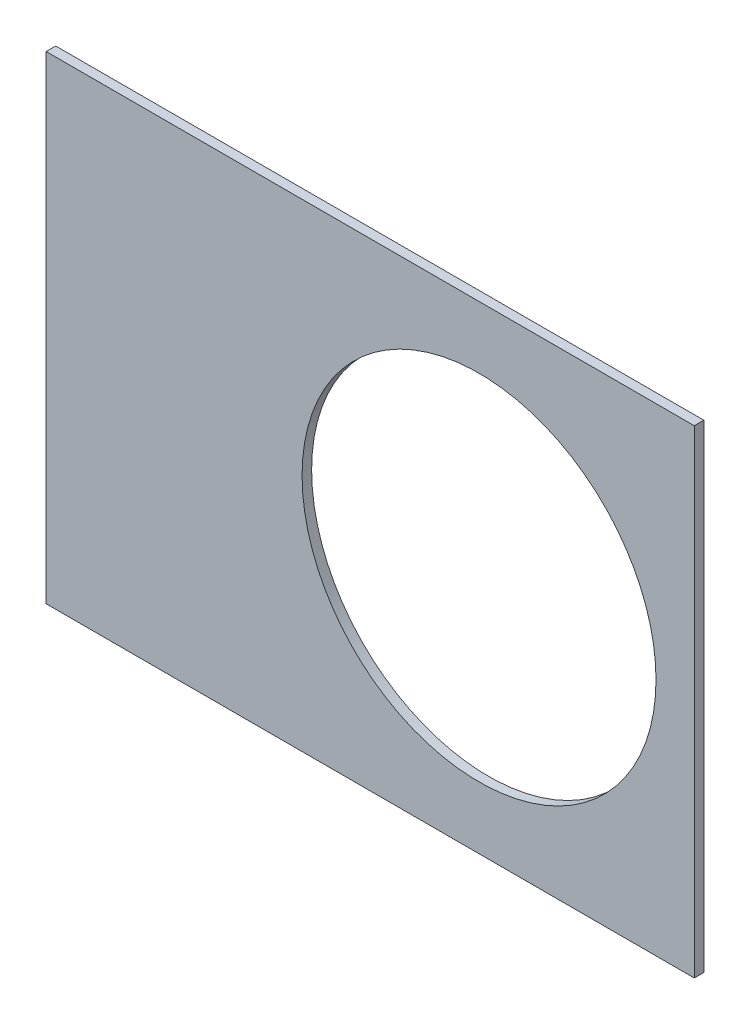
ISO-10303-21;
HEADER;
FILE_DESCRIPTION(('STEP AP214'),'2;1');
FILE_NAME('part.step','',(''),(''),'','','');
FILE_SCHEMA(('AUTOMOTIVE_DESIGN { 1 0 10303 214 1 1 1 1 }'));
ENDSEC;
DATA;
#1=APPLICATION_CONTEXT('core data for automotive mechanical design processes');
#2=APPLICATION_PROTOCOL_DEFINITION('international standard','automotive_design',2000,#1);
#3=PRODUCT_CONTEXT('',#1,'mechanical');
#4=PRODUCT('Part','Part','',(#3));
#5=PRODUCT_RELATED_PRODUCT_CATEGORY('part','',(#4));
#6=PRODUCT_DEFINITION_FORMATION('','',#4);
#7=PRODUCT_DEFINITION_CONTEXT('part definition',#1,'design');
#8=PRODUCT_DEFINITION('design','',#6,#7);
#9=PRODUCT_DEFINITION_SHAPE('','',#8);
#10=(LENGTH_UNIT() NAMED_UNIT(*) SI_UNIT(.MILLI.,.METRE.));
#11=(NAMED_UNIT(*) PLANE_ANGLE_UNIT() SI_UNIT($,.RADIAN.));
#12=(NAMED_UNIT(*) SI_UNIT($,.STERADIAN.) SOLID_ANGLE_UNIT());
#13=UNCERTAINTY_MEASURE_WITH_UNIT(LENGTH_MEASURE(1.E-05),#10,'distance_accuracy_value','');
#14=(GEOMETRIC_REPRESENTATION_CONTEXT(3) GLOBAL_UNCERTAINTY_ASSIGNED_CONTEXT((#13)) GLOBAL_UNIT_ASSIGNED_CONTEXT((#10,
#11,#12)) REPRESENTATION_CONTEXT('',''));
#15=CARTESIAN_POINT('',(0.,0.,0.));
#16=DIRECTION('',(0.,0.,1.));
#17=DIRECTION('',(1.,0.,0.));
#18=AXIS2_PLACEMENT_3D('',#15,#16,#17);
#19=CARTESIAN_POINT('',(0.,0.,0.254));
#20=DIRECTION('',(0.,0.,-1.));
#21=DIRECTION('',(-1.,0.,0.));
#22=AXIS2_PLACEMENT_3D('',#19,#20,#21);
#23=PLANE('',#22);
#24=CARTESIAN_POINT('',(61.722,0.,0.254));
#25=DIRECTION('',(0.,0.,1.));
#26=DIRECTION('',(1.,0.,0.));
#27=AXIS2_PLACEMENT_3D('',#24,#25,#26);
#28=CIRCLE('',#27,4.69899999999999);
#29=CARTESIAN_POINT('',(66.421,0.,0.254));
#30=VERTEX_POINT('',#29);
#31=EDGE_CURVE('E99',#30,#30,#28,.T.);
#32=ORIENTED_EDGE('',*,*,#31,.F.);
#33=EDGE_LOOP('',(#32));
#34=FACE_BOUND('',#33,.T.);
#35=DIRECTION('',(1.,0.,0.));
#36=VECTOR('',#35,1.);
#37=CARTESIAN_POINT('',(88.6729242779328,6.35,0.254));
#38=LINE('',#37,#36);
#39=CARTESIAN_POINT('',(50.2285,6.34999999999999,0.254));
#40=VERTEX_POINT('',#39);
#41=CARTESIAN_POINT('',(67.437,6.35,0.254));
#42=VERTEX_POINT('',#41);
#43=EDGE_CURVE('E88',#40,#42,#38,.T.);
#44=ORIENTED_EDGE('',*,*,#43,.F.);
#45=DIRECTION('',(0.,1.,0.));
#46=VECTOR('',#45,1.);
#47=CARTESIAN_POINT('',(50.2285,-6.35000000000001,0.254));
#48=LINE('',#47,#46);
#49=CARTESIAN_POINT('',(50.2285,-6.35000000000001,0.254));
#50=VERTEX_POINT('',#49);
#51=EDGE_CURVE('E72',#50,#40,#48,.T.);
#52=ORIENTED_EDGE('',*,*,#51,.F.);
#53=DIRECTION('',(1.,0.,0.));
#54=VECTOR('',#53,1.);
#55=CARTESIAN_POINT('',(101.401368333963,-6.35,0.254));
#56=LINE('',#55,#54);
#57=CARTESIAN_POINT('',(67.437,-6.35000000000001,0.254));
#58=VERTEX_POINT('',#57);
#59=EDGE_CURVE('E12',#50,#58,#56,.T.);
#60=ORIENTED_EDGE('',*,*,#59,.T.);
#61=DIRECTION('',(0.,-1.,0.));
#62=VECTOR('',#61,1.);
#63=CARTESIAN_POINT('',(67.437,-6.35000000000001,0.254));
#64=LINE('',#63,#62);
#65=EDGE_CURVE('E93',#42,#58,#64,.T.);
#66=ORIENTED_EDGE('',*,*,#65,.F.);
#67=EDGE_LOOP('',(#44,#52,#60,#66));
#68=FACE_BOUND('',#67,.T.);
#69=ADVANCED_FACE('F35',(#34,#68),#23,.F.);
#70=CARTESIAN_POINT('',(0.,0.,0.));
#71=DIRECTION('',(0.,0.,-1.));
#72=DIRECTION('',(-1.,0.,0.));
#73=AXIS2_PLACEMENT_3D('',#70,#71,#72);
#74=PLANE('',#73);
#75=CARTESIAN_POINT('',(61.722,0.,0.));
#76=DIRECTION('',(0.,0.,1.));
#77=DIRECTION('',(1.,0.,0.));
#78=AXIS2_PLACEMENT_3D('',#75,#76,#77);
#79=CIRCLE('',#78,4.69899999999999);
#80=CARTESIAN_POINT('',(66.421,0.,0.));
#81=VERTEX_POINT('',#80);
#82=EDGE_CURVE('E96',#81,#81,#79,.T.);
#83=ORIENTED_EDGE('',*,*,#82,.T.);
#84=EDGE_LOOP('',(#83));
#85=FACE_BOUND('',#84,.T.);
#86=DIRECTION('',(0.,1.,0.));
#87=VECTOR('',#86,1.);
#88=CARTESIAN_POINT('',(50.2285,-6.35000000000001,0.));
#89=LINE('',#88,#87);
#90=CARTESIAN_POINT('',(50.2285,-6.35000000000001,0.));
#91=VERTEX_POINT('',#90);
#92=CARTESIAN_POINT('',(50.2285,6.34999999999999,0.));
#93=VERTEX_POINT('',#92);
#94=EDGE_CURVE('E81',#91,#93,#89,.T.);
#95=ORIENTED_EDGE('',*,*,#94,.T.);
#96=DIRECTION('',(1.,0.,0.));
#97=VECTOR('',#96,1.);
#98=CARTESIAN_POINT('',(88.6729242779328,6.35,0.));
#99=LINE('',#98,#97);
#100=CARTESIAN_POINT('',(67.437,6.35,0.));
#101=VERTEX_POINT('',#100);
#102=EDGE_CURVE('E90',#93,#101,#99,.T.);
#103=ORIENTED_EDGE('',*,*,#102,.T.);
#104=DIRECTION('',(0.,-1.,0.));
#105=VECTOR('',#104,1.);
#106=CARTESIAN_POINT('',(67.437,-6.35000000000001,0.));
#107=LINE('',#106,#105);
#108=CARTESIAN_POINT('',(67.437,-6.35000000000001,0.));
#109=VERTEX_POINT('',#108);
#110=EDGE_CURVE('E106',#101,#109,#107,.T.);
#111=ORIENTED_EDGE('',*,*,#110,.T.);
#112=DIRECTION('',(1.,0.,0.));
#113=VECTOR('',#112,1.);
#114=CARTESIAN_POINT('',(101.401368333963,-6.35,0.));
#115=LINE('',#114,#113);
#116=EDGE_CURVE('E39',#91,#109,#115,.T.);
#117=ORIENTED_EDGE('',*,*,#116,.F.);
#118=EDGE_LOOP('',(#95,#103,#111,#117));
#119=FACE_BOUND('',#118,.T.);
#120=ADVANCED_FACE('F114',(#85,#119),#74,.T.);
#121=CARTESIAN_POINT('',(88.6729242779328,6.35,0.254));
#122=DIRECTION('',(0.,1.,0.));
#123=DIRECTION('',(-1.,0.,0.));
#124=AXIS2_PLACEMENT_3D('',#121,#122,#123);
#125=PLANE('',#124);
#126=ORIENTED_EDGE('',*,*,#102,.F.);
#127=DIRECTION('',(0.,0.,1.));
#128=VECTOR('',#127,1.);
#129=CARTESIAN_POINT('',(50.2285,6.34999999999999,0.254));
#130=LINE('',#129,#128);
#131=EDGE_CURVE('E75',#93,#40,#130,.T.);
#132=ORIENTED_EDGE('',*,*,#131,.T.);
#133=ORIENTED_EDGE('',*,*,#43,.T.);
#134=DIRECTION('',(0.,0.,-1.));
#135=VECTOR('',#134,1.);
#136=CARTESIAN_POINT('',(67.437,6.35,0.254));
#137=LINE('',#136,#135);
#138=EDGE_CURVE('E82',#42,#101,#137,.T.);
#139=ORIENTED_EDGE('',*,*,#138,.T.);
#140=EDGE_LOOP('',(#126,#132,#133,#139));
#141=FACE_BOUND('',#140,.T.);
#142=ADVANCED_FACE('F86',(#141),#125,.T.);
#143=CARTESIAN_POINT('',(101.401368333963,-6.35,0.254));
#144=DIRECTION('',(0.,1.,0.));
#145=DIRECTION('',(-1.,0.,0.));
#146=AXIS2_PLACEMENT_3D('',#143,#144,#145);
#147=PLANE('',#146);
#148=ORIENTED_EDGE('',*,*,#59,.F.);
#149=DIRECTION('',(0.,0.,1.));
#150=VECTOR('',#149,1.);
#151=CARTESIAN_POINT('',(50.2285,-6.35000000000001,0.));
#152=LINE('',#151,#150);
#153=EDGE_CURVE('E77',#91,#50,#152,.T.);
#154=ORIENTED_EDGE('',*,*,#153,.F.);
#155=ORIENTED_EDGE('',*,*,#116,.T.);
#156=DIRECTION('',(0.,0.,1.));
#157=VECTOR('',#156,1.);
#158=CARTESIAN_POINT('',(67.437,-6.35000000000001,0.));
#159=LINE('',#158,#157);
#160=EDGE_CURVE('E102',#109,#58,#159,.T.);
#161=ORIENTED_EDGE('',*,*,#160,.T.);
#162=EDGE_LOOP('',(#148,#154,#155,#161));
#163=FACE_BOUND('',#162,.T.);
#164=ADVANCED_FACE('F37',(#163),#147,.F.);
#165=CARTESIAN_POINT('',(61.722,0.,0.));
#166=DIRECTION('',(0.,0.,1.));
#167=DIRECTION('',(1.,0.,0.));
#168=AXIS2_PLACEMENT_3D('',#165,#166,#167);
#169=CYLINDRICAL_SURFACE('',#168,4.69899999999999);
#170=ORIENTED_EDGE('',*,*,#82,.F.);
#171=EDGE_LOOP('',(#170));
#172=FACE_BOUND('',#171,.T.);
#173=ORIENTED_EDGE('',*,*,#31,.T.);
#174=EDGE_LOOP('',(#173));
#175=FACE_BOUND('',#174,.T.);
#176=ADVANCED_FACE('F117',(#172,#175),#169,.F.);
#177=CARTESIAN_POINT('',(67.437,-6.35000000000001,0.));
#178=DIRECTION('',(-1.,0.,0.));
#179=DIRECTION('',(0.,0.,1.));
#180=AXIS2_PLACEMENT_3D('',#177,#178,#179);
#181=PLANE('',#180);
#182=ORIENTED_EDGE('',*,*,#65,.T.);
#183=ORIENTED_EDGE('',*,*,#160,.F.);
#184=ORIENTED_EDGE('',*,*,#110,.F.);
#185=ORIENTED_EDGE('',*,*,#138,.F.);
#186=EDGE_LOOP('',(#182,#183,#184,#185));
#187=FACE_BOUND('',#186,.T.);
#188=ADVANCED_FACE('F115',(#187),#181,.F.);
#189=CARTESIAN_POINT('',(50.2285,-6.35000000000001,0.));
#190=DIRECTION('',(1.,0.,0.));
#191=DIRECTION('',(0.,0.,-1.));
#192=AXIS2_PLACEMENT_3D('',#189,#190,#191);
#193=PLANE('',#192);
#194=ORIENTED_EDGE('',*,*,#51,.T.);
#195=ORIENTED_EDGE('',*,*,#131,.F.);
#196=ORIENTED_EDGE('',*,*,#94,.F.);
#197=ORIENTED_EDGE('',*,*,#153,.T.);
#198=EDGE_LOOP('',(#194,#195,#196,#197));
#199=FACE_BOUND('',#198,.T.);
#200=ADVANCED_FACE('F74',(#199),#193,.F.);
#201=CLOSED_SHELL('',(#69,#120,#142,#164,#176,#188,#200));
#202=MANIFOLD_SOLID_BREP('B2',#201);
#203=ADVANCED_BREP_SHAPE_REPRESENTATION('',(#18,#202),#14);
#204=SHAPE_DEFINITION_REPRESENTATION(#9,#203);
ENDSEC;
END-ISO-10303-21;
